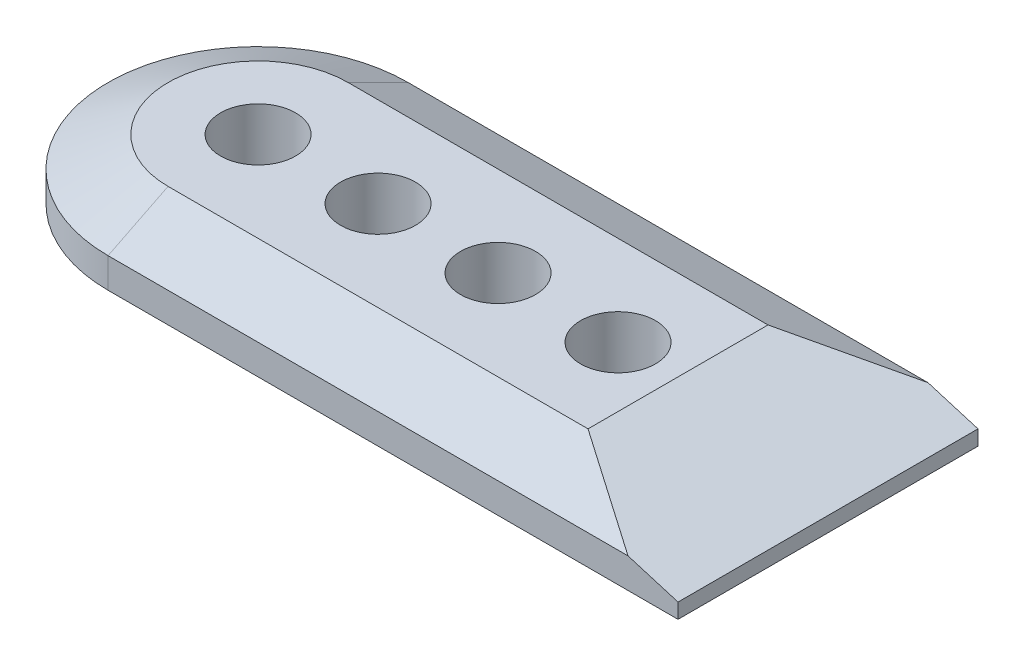
ISO-10303-21;
HEADER;
FILE_DESCRIPTION(('STEP AP214'),'2;1');
FILE_NAME('part.step','',(''),(''),'','','');
FILE_SCHEMA(('AUTOMOTIVE_DESIGN { 1 0 10303 214 1 1 1 1 }'));
ENDSEC;
DATA;
#1=APPLICATION_CONTEXT('core data for automotive mechanical design processes');
#2=APPLICATION_PROTOCOL_DEFINITION('international standard','automotive_design',2000,#1);
#3=PRODUCT_CONTEXT('',#1,'mechanical');
#4=PRODUCT('Part','Part','',(#3));
#5=PRODUCT_RELATED_PRODUCT_CATEGORY('part','',(#4));
#6=PRODUCT_DEFINITION_FORMATION('','',#4);
#7=PRODUCT_DEFINITION_CONTEXT('part definition',#1,'design');
#8=PRODUCT_DEFINITION('design','',#6,#7);
#9=PRODUCT_DEFINITION_SHAPE('','',#8);
#10=(LENGTH_UNIT() NAMED_UNIT(*) SI_UNIT(.MILLI.,.METRE.));
#11=(NAMED_UNIT(*) PLANE_ANGLE_UNIT() SI_UNIT($,.RADIAN.));
#12=(NAMED_UNIT(*) SI_UNIT($,.STERADIAN.) SOLID_ANGLE_UNIT());
#13=UNCERTAINTY_MEASURE_WITH_UNIT(LENGTH_MEASURE(1.E-05),#10,'distance_accuracy_value','');
#14=(GEOMETRIC_REPRESENTATION_CONTEXT(3) GLOBAL_UNCERTAINTY_ASSIGNED_CONTEXT((#13)) GLOBAL_UNIT_ASSIGNED_CONTEXT((#10,
#11,#12)) REPRESENTATION_CONTEXT('',''));
#15=CARTESIAN_POINT('',(0.,0.,0.));
#16=DIRECTION('',(0.,0.,1.));
#17=DIRECTION('',(1.,0.,0.));
#18=AXIS2_PLACEMENT_3D('',#15,#16,#17);
#19=CARTESIAN_POINT('',(-47.5,5.,0.));
#20=DIRECTION('',(0.,1.,0.));
#21=DIRECTION('',(0.,0.,1.));
#22=AXIS2_PLACEMENT_3D('',#19,#20,#21);
#23=PLANE('',#22);
#24=CARTESIAN_POINT('',(-27.5,5.,0.));
#25=DIRECTION('',(0.,1.,0.));
#26=DIRECTION('',(0.,0.,1.));
#27=AXIS2_PLACEMENT_3D('',#24,#25,#26);
#28=CIRCLE('',#27,3.125);
#29=CARTESIAN_POINT('',(-27.5,5.,3.125));
#30=VERTEX_POINT('',#29);
#31=EDGE_CURVE('E321',#30,#30,#28,.T.);
#32=ORIENTED_EDGE('',*,*,#31,.F.);
#33=EDGE_LOOP('',(#32));
#34=FACE_BOUND('',#33,.T.);
#35=CARTESIAN_POINT('',(-47.5,5.,0.));
#36=DIRECTION('',(0.,1.,0.));
#37=DIRECTION('',(0.,0.,1.));
#38=AXIS2_PLACEMENT_3D('',#35,#36,#37);
#39=CIRCLE('',#38,3.125);
#40=CARTESIAN_POINT('',(-47.5,5.,3.125));
#41=VERTEX_POINT('',#40);
#42=EDGE_CURVE('E116',#41,#41,#39,.T.);
#43=ORIENTED_EDGE('',*,*,#42,.F.);
#44=EDGE_LOOP('',(#43));
#45=FACE_BOUND('',#44,.T.);
#46=DIRECTION('',(1.,0.,0.));
#47=VECTOR('',#46,1.);
#48=CARTESIAN_POINT('',(0.,5.,7.49999999999996));
#49=LINE('',#48,#47);
#50=CARTESIAN_POINT('',(-47.5,5.,7.49999999999998));
#51=VERTEX_POINT('',#50);
#52=CARTESIAN_POINT('',(-12.5000000000002,5.,7.49999999999996));
#53=VERTEX_POINT('',#52);
#54=EDGE_CURVE('E133',#51,#53,#49,.T.);
#55=ORIENTED_EDGE('',*,*,#54,.T.);
#56=DIRECTION('',(0.,0.,-1.));
#57=VECTOR('',#56,1.);
#58=CARTESIAN_POINT('',(-12.5000000000002,5.,-7.49999999999997));
#59=LINE('',#58,#57);
#60=CARTESIAN_POINT('',(-12.5000000000002,5.,-7.49999999999997));
#61=VERTEX_POINT('',#60);
#62=EDGE_CURVE('E143',#53,#61,#59,.T.);
#63=ORIENTED_EDGE('',*,*,#62,.T.);
#64=DIRECTION('',(-1.,0.,0.));
#65=VECTOR('',#64,1.);
#66=CARTESIAN_POINT('',(-47.5,5.,-7.49999999999997));
#67=LINE('',#66,#65);
#68=CARTESIAN_POINT('',(-47.5,5.,-7.49999999999997));
#69=VERTEX_POINT('',#68);
#70=EDGE_CURVE('E100',#61,#69,#67,.T.);
#71=ORIENTED_EDGE('',*,*,#70,.T.);
#72=CARTESIAN_POINT('',(-47.5,5.,0.));
#73=DIRECTION('',(0.,1.,0.));
#74=DIRECTION('',(0.,0.,1.));
#75=AXIS2_PLACEMENT_3D('',#72,#73,#74);
#76=CIRCLE('',#75,7.49999999999997);
#77=EDGE_CURVE('E131',#69,#51,#76,.T.);
#78=ORIENTED_EDGE('',*,*,#77,.T.);
#79=EDGE_LOOP('',(#55,#63,#71,#78));
#80=FACE_BOUND('',#79,.T.);
#81=CARTESIAN_POINT('',(-37.5,5.,0.));
#82=DIRECTION('',(0.,1.,0.));
#83=DIRECTION('',(0.,0.,1.));
#84=AXIS2_PLACEMENT_3D('',#81,#82,#83);
#85=CIRCLE('',#84,3.125);
#86=CARTESIAN_POINT('',(-37.5,5.,3.125));
#87=VERTEX_POINT('',#86);
#88=EDGE_CURVE('E315',#87,#87,#85,.T.);
#89=ORIENTED_EDGE('',*,*,#88,.F.);
#90=EDGE_LOOP('',(#89));
#91=FACE_BOUND('',#90,.T.);
#92=CARTESIAN_POINT('',(-17.5,5.,0.));
#93=DIRECTION('',(0.,1.,0.));
#94=DIRECTION('',(0.,0.,1.));
#95=AXIS2_PLACEMENT_3D('',#92,#93,#94);
#96=CIRCLE('',#95,3.125);
#97=CARTESIAN_POINT('',(-17.5,5.,3.125));
#98=VERTEX_POINT('',#97);
#99=EDGE_CURVE('E327',#98,#98,#96,.T.);
#100=ORIENTED_EDGE('',*,*,#99,.F.);
#101=EDGE_LOOP('',(#100));
#102=FACE_BOUND('',#101,.T.);
#103=ADVANCED_FACE('F37',(#34,#45,#80,#91,#102),#23,.T.);
#104=CARTESIAN_POINT('',(-47.5,0.,0.));
#105=DIRECTION('',(0.,1.,0.));
#106=DIRECTION('',(0.,0.,1.));
#107=AXIS2_PLACEMENT_3D('',#104,#105,#106);
#108=PLANE('',#107);
#109=DIRECTION('',(1.,0.,0.));
#110=VECTOR('',#109,1.);
#111=CARTESIAN_POINT('',(0.,0.,12.5));
#112=LINE('',#111,#110);
#113=CARTESIAN_POINT('',(-47.5,0.,12.5));
#114=VERTEX_POINT('',#113);
#115=CARTESIAN_POINT('',(0.,0.,12.5));
#116=VERTEX_POINT('',#115);
#117=EDGE_CURVE('E108',#114,#116,#112,.T.);
#118=ORIENTED_EDGE('',*,*,#117,.F.);
#119=CARTESIAN_POINT('',(-47.5,0.,0.));
#120=DIRECTION('',(0.,1.,0.));
#121=DIRECTION('',(0.,0.,1.));
#122=AXIS2_PLACEMENT_3D('',#119,#120,#121);
#123=CIRCLE('',#122,12.5);
#124=CARTESIAN_POINT('',(-47.5,0.,-12.5));
#125=VERTEX_POINT('',#124);
#126=EDGE_CURVE('E124',#125,#114,#123,.T.);
#127=ORIENTED_EDGE('',*,*,#126,.F.);
#128=DIRECTION('',(-1.,0.,0.));
#129=VECTOR('',#128,1.);
#130=CARTESIAN_POINT('',(0.,0.,-12.5));
#131=LINE('',#130,#129);
#132=CARTESIAN_POINT('',(0.,0.,-12.5));
#133=VERTEX_POINT('',#132);
#134=EDGE_CURVE('E110',#133,#125,#131,.T.);
#135=ORIENTED_EDGE('',*,*,#134,.F.);
#136=DIRECTION('',(0.,0.,-1.));
#137=VECTOR('',#136,1.);
#138=CARTESIAN_POINT('',(0.,0.,12.5));
#139=LINE('',#138,#137);
#140=EDGE_CURVE('E97',#116,#133,#139,.T.);
#141=ORIENTED_EDGE('',*,*,#140,.F.);
#142=EDGE_LOOP('',(#118,#127,#135,#141));
#143=FACE_BOUND('',#142,.T.);
#144=CARTESIAN_POINT('',(-47.5,0.,0.));
#145=DIRECTION('',(0.,1.,0.));
#146=DIRECTION('',(0.,0.,1.));
#147=AXIS2_PLACEMENT_3D('',#144,#145,#146);
#148=CIRCLE('',#147,3.125);
#149=CARTESIAN_POINT('',(-47.5,0.,3.125));
#150=VERTEX_POINT('',#149);
#151=EDGE_CURVE('E119',#150,#150,#148,.T.);
#152=ORIENTED_EDGE('',*,*,#151,.T.);
#153=EDGE_LOOP('',(#152));
#154=FACE_BOUND('',#153,.T.);
#155=CARTESIAN_POINT('',(-37.5,0.,0.));
#156=DIRECTION('',(0.,1.,0.));
#157=DIRECTION('',(0.,0.,1.));
#158=AXIS2_PLACEMENT_3D('',#155,#156,#157);
#159=CIRCLE('',#158,3.125);
#160=CARTESIAN_POINT('',(-37.5,0.,3.125));
#161=VERTEX_POINT('',#160);
#162=EDGE_CURVE('E317',#161,#161,#159,.T.);
#163=ORIENTED_EDGE('',*,*,#162,.T.);
#164=EDGE_LOOP('',(#163));
#165=FACE_BOUND('',#164,.T.);
#166=CARTESIAN_POINT('',(-27.5,0.,0.));
#167=DIRECTION('',(0.,1.,0.));
#168=DIRECTION('',(0.,0.,1.));
#169=AXIS2_PLACEMENT_3D('',#166,#167,#168);
#170=CIRCLE('',#169,3.125);
#171=CARTESIAN_POINT('',(-27.5,0.,3.125));
#172=VERTEX_POINT('',#171);
#173=EDGE_CURVE('E324',#172,#172,#170,.T.);
#174=ORIENTED_EDGE('',*,*,#173,.T.);
#175=EDGE_LOOP('',(#174));
#176=FACE_BOUND('',#175,.T.);
#177=CARTESIAN_POINT('',(-17.5,0.,0.));
#178=DIRECTION('',(0.,1.,0.));
#179=DIRECTION('',(0.,0.,1.));
#180=AXIS2_PLACEMENT_3D('',#177,#178,#179);
#181=CIRCLE('',#180,3.125);
#182=CARTESIAN_POINT('',(-17.5,0.,3.125));
#183=VERTEX_POINT('',#182);
#184=EDGE_CURVE('E150',#183,#183,#181,.T.);
#185=ORIENTED_EDGE('',*,*,#184,.T.);
#186=EDGE_LOOP('',(#185));
#187=FACE_BOUND('',#186,.T.);
#188=ADVANCED_FACE('F105',(#143,#154,#165,#176,#187),#108,.F.);
#189=CARTESIAN_POINT('',(0.,5.,12.5));
#190=DIRECTION('',(0.,0.,-1.));
#191=DIRECTION('',(-1.,0.,0.));
#192=AXIS2_PLACEMENT_3D('',#189,#190,#191);
#193=PLANE('',#192);
#194=DIRECTION('',(0.,-1.,0.));
#195=VECTOR('',#194,1.);
#196=CARTESIAN_POINT('',(0.,5.,12.5));
#197=LINE('',#196,#195);
#198=CARTESIAN_POINT('',(0.,1.24999999999999,12.5));
#199=VERTEX_POINT('',#198);
#200=EDGE_CURVE('E94',#199,#116,#197,.T.);
#201=ORIENTED_EDGE('',*,*,#200,.F.);
#202=DIRECTION('',(-0.957826285221152,0.287347885566343,0.));
#203=VECTOR('',#202,1.);
#204=CARTESIAN_POINT('',(-12.5000000000002,5.,12.5));
#205=LINE('',#204,#203);
#206=CARTESIAN_POINT('',(-4.16666666666672,2.49999999999999,12.5));
#207=VERTEX_POINT('',#206);
#208=EDGE_CURVE('E46',#199,#207,#205,.T.);
#209=ORIENTED_EDGE('',*,*,#208,.T.);
#210=DIRECTION('',(-1.,0.,0.));
#211=VECTOR('',#210,1.);
#212=CARTESIAN_POINT('',(-47.5,2.49999999999999,12.5));
#213=LINE('',#212,#211);
#214=CARTESIAN_POINT('',(-47.5,2.5,12.5));
#215=VERTEX_POINT('',#214);
#216=EDGE_CURVE('E136',#207,#215,#213,.T.);
#217=ORIENTED_EDGE('',*,*,#216,.T.);
#218=DIRECTION('',(0.,-1.,0.));
#219=VECTOR('',#218,1.);
#220=CARTESIAN_POINT('',(-47.5,5.,12.5));
#221=LINE('',#220,#219);
#222=EDGE_CURVE('E114',#215,#114,#221,.T.);
#223=ORIENTED_EDGE('',*,*,#222,.T.);
#224=ORIENTED_EDGE('',*,*,#117,.T.);
#225=EDGE_LOOP('',(#201,#209,#217,#223,#224));
#226=FACE_BOUND('',#225,.T.);
#227=ADVANCED_FACE('F112',(#226),#193,.F.);
#228=CARTESIAN_POINT('',(0.,5.,12.5));
#229=DIRECTION('',(-1.,0.,0.));
#230=DIRECTION('',(0.,0.,1.));
#231=AXIS2_PLACEMENT_3D('',#228,#229,#230);
#232=PLANE('',#231);
#233=DIRECTION('',(0.,-1.,0.));
#234=VECTOR('',#233,1.);
#235=CARTESIAN_POINT('',(0.,5.,-12.5));
#236=LINE('',#235,#234);
#237=CARTESIAN_POINT('',(0.,1.24999999999999,-12.5));
#238=VERTEX_POINT('',#237);
#239=EDGE_CURVE('E101',#238,#133,#236,.T.);
#240=ORIENTED_EDGE('',*,*,#239,.F.);
#241=DIRECTION('',(0.,0.,1.));
#242=VECTOR('',#241,1.);
#243=CARTESIAN_POINT('',(0.,1.24999999999999,7.49999999999996));
#244=LINE('',#243,#242);
#245=EDGE_CURVE('E60',#238,#199,#244,.T.);
#246=ORIENTED_EDGE('',*,*,#245,.T.);
#247=ORIENTED_EDGE('',*,*,#200,.T.);
#248=ORIENTED_EDGE('',*,*,#140,.T.);
#249=EDGE_LOOP('',(#240,#246,#247,#248));
#250=FACE_BOUND('',#249,.T.);
#251=ADVANCED_FACE('F96',(#250),#232,.F.);
#252=CARTESIAN_POINT('',(0.,5.,-12.5));
#253=DIRECTION('',(0.,0.,1.));
#254=DIRECTION('',(1.,0.,0.));
#255=AXIS2_PLACEMENT_3D('',#252,#253,#254);
#256=PLANE('',#255);
#257=DIRECTION('',(1.,0.,0.));
#258=VECTOR('',#257,1.);
#259=CARTESIAN_POINT('',(0.,2.5,-12.5));
#260=LINE('',#259,#258);
#261=CARTESIAN_POINT('',(-47.5,2.5,-12.5));
#262=VERTEX_POINT('',#261);
#263=CARTESIAN_POINT('',(-4.16666666666675,2.5,-12.5));
#264=VERTEX_POINT('',#263);
#265=EDGE_CURVE('E140',#262,#264,#260,.T.);
#266=ORIENTED_EDGE('',*,*,#265,.T.);
#267=DIRECTION('',(0.957826285221152,-0.287347885566343,0.));
#268=VECTOR('',#267,1.);
#269=CARTESIAN_POINT('',(-12.5000000000002,5.,-12.5));
#270=LINE('',#269,#268);
#271=EDGE_CURVE('E155',#264,#238,#270,.T.);
#272=ORIENTED_EDGE('',*,*,#271,.T.);
#273=ORIENTED_EDGE('',*,*,#239,.T.);
#274=ORIENTED_EDGE('',*,*,#134,.T.);
#275=DIRECTION('',(0.,-1.,0.));
#276=VECTOR('',#275,1.);
#277=CARTESIAN_POINT('',(-47.5,5.,-12.5));
#278=LINE('',#277,#276);
#279=EDGE_CURVE('E127',#262,#125,#278,.T.);
#280=ORIENTED_EDGE('',*,*,#279,.F.);
#281=EDGE_LOOP('',(#266,#272,#273,#274,#280));
#282=FACE_BOUND('',#281,.T.);
#283=ADVANCED_FACE('F159',(#282),#256,.F.);
#284=CARTESIAN_POINT('',(-47.5,5.,0.));
#285=DIRECTION('',(0.,-1.,0.));
#286=DIRECTION('',(0.,0.,-1.));
#287=AXIS2_PLACEMENT_3D('',#284,#285,#286);
#288=CYLINDRICAL_SURFACE('',#287,12.5);
#289=ORIENTED_EDGE('',*,*,#222,.F.);
#290=CARTESIAN_POINT('',(-47.5,2.5,0.));
#291=DIRECTION('',(0.,1.,0.));
#292=DIRECTION('',(0.,0.,1.));
#293=AXIS2_PLACEMENT_3D('',#290,#291,#292);
#294=CIRCLE('',#293,12.5);
#295=EDGE_CURVE('E138',#215,#262,#294,.F.);
#296=ORIENTED_EDGE('',*,*,#295,.T.);
#297=ORIENTED_EDGE('',*,*,#279,.T.);
#298=ORIENTED_EDGE('',*,*,#126,.T.);
#299=EDGE_LOOP('',(#289,#296,#297,#298));
#300=FACE_BOUND('',#299,.T.);
#301=ADVANCED_FACE('F178',(#300),#288,.T.);
#302=CARTESIAN_POINT('',(-47.5,5.,0.));
#303=DIRECTION('',(0.,-1.,0.));
#304=DIRECTION('',(0.,0.,-1.));
#305=AXIS2_PLACEMENT_3D('',#302,#303,#304);
#306=CYLINDRICAL_SURFACE('',#305,3.125);
#307=ORIENTED_EDGE('',*,*,#42,.T.);
#308=EDGE_LOOP('',(#307));
#309=FACE_BOUND('',#308,.T.);
#310=ORIENTED_EDGE('',*,*,#151,.F.);
#311=EDGE_LOOP('',(#310));
#312=FACE_BOUND('',#311,.T.);
#313=ADVANCED_FACE('F202',(#309,#312),#306,.F.);
#314=CARTESIAN_POINT('',(-37.5,5.,0.));
#315=DIRECTION('',(0.,-1.,0.));
#316=DIRECTION('',(0.,0.,-1.));
#317=AXIS2_PLACEMENT_3D('',#314,#315,#316);
#318=CYLINDRICAL_SURFACE('',#317,3.125);
#319=ORIENTED_EDGE('',*,*,#88,.T.);
#320=EDGE_LOOP('',(#319));
#321=FACE_BOUND('',#320,.T.);
#322=ORIENTED_EDGE('',*,*,#162,.F.);
#323=EDGE_LOOP('',(#322));
#324=FACE_BOUND('',#323,.T.);
#325=ADVANCED_FACE('F287',(#321,#324),#318,.F.);
#326=CARTESIAN_POINT('',(-27.5,5.,0.));
#327=DIRECTION('',(0.,-1.,0.));
#328=DIRECTION('',(0.,0.,-1.));
#329=AXIS2_PLACEMENT_3D('',#326,#327,#328);
#330=CYLINDRICAL_SURFACE('',#329,3.125);
#331=ORIENTED_EDGE('',*,*,#31,.T.);
#332=EDGE_LOOP('',(#331));
#333=FACE_BOUND('',#332,.T.);
#334=ORIENTED_EDGE('',*,*,#173,.F.);
#335=EDGE_LOOP('',(#334));
#336=FACE_BOUND('',#335,.T.);
#337=ADVANCED_FACE('F188',(#333,#336),#330,.F.);
#338=CARTESIAN_POINT('',(-17.5,5.,0.));
#339=DIRECTION('',(0.,-1.,0.));
#340=DIRECTION('',(0.,0.,-1.));
#341=AXIS2_PLACEMENT_3D('',#338,#339,#340);
#342=CYLINDRICAL_SURFACE('',#341,3.125);
#343=ORIENTED_EDGE('',*,*,#99,.T.);
#344=EDGE_LOOP('',(#343));
#345=FACE_BOUND('',#344,.T.);
#346=ORIENTED_EDGE('',*,*,#184,.F.);
#347=EDGE_LOOP('',(#346));
#348=FACE_BOUND('',#347,.T.);
#349=ADVANCED_FACE('F182',(#345,#348),#342,.F.);
#350=CARTESIAN_POINT('',(-47.5,5.,-7.49999999999997));
#351=DIRECTION('',(0.,0.894427190999917,-0.447213595499956));
#352=DIRECTION('',(1.,0.,0.));
#353=AXIS2_PLACEMENT_3D('',#350,#351,#352);
#354=PLANE('',#353);
#355=ORIENTED_EDGE('',*,*,#70,.F.);
#356=DIRECTION('',(0.830454798537401,-0.249136439561218,-0.498272879122438));
#357=VECTOR('',#356,1.);
#358=CARTESIAN_POINT('',(-36.6379310344829,12.2413793103447,6.9827586206896));
#359=LINE('',#358,#357);
#360=EDGE_CURVE('E153',#61,#264,#359,.T.);
#361=ORIENTED_EDGE('',*,*,#360,.T.);
#362=ORIENTED_EDGE('',*,*,#265,.F.);
#363=DIRECTION('',(0.,-0.447213595499956,-0.894427190999917));
#364=VECTOR('',#363,1.);
#365=CARTESIAN_POINT('',(-47.5,5.,-7.49999999999997));
#366=LINE('',#365,#364);
#367=EDGE_CURVE('E147',#69,#262,#366,.T.);
#368=ORIENTED_EDGE('',*,*,#367,.F.);
#369=EDGE_LOOP('',(#355,#361,#362,#368));
#370=FACE_BOUND('',#369,.T.);
#371=ADVANCED_FACE('F180',(#370),#354,.T.);
#372=CARTESIAN_POINT('',(-47.5,5.,0.));
#373=DIRECTION('',(0.,-1.,0.));
#374=DIRECTION('',(0.,0.,-1.));
#375=AXIS2_PLACEMENT_3D('',#372,#373,#374);
#376=CONICAL_SURFACE('',#375,7.49999999999997,1.10714871779409);
#377=ORIENTED_EDGE('',*,*,#367,.T.);
#378=ORIENTED_EDGE('',*,*,#295,.F.);
#379=DIRECTION('',(0.,-0.447213595499956,0.894427190999917));
#380=VECTOR('',#379,1.);
#381=CARTESIAN_POINT('',(-47.5,5.,7.49999999999998));
#382=LINE('',#381,#380);
#383=EDGE_CURVE('E144',#51,#215,#382,.T.);
#384=ORIENTED_EDGE('',*,*,#383,.F.);
#385=ORIENTED_EDGE('',*,*,#77,.F.);
#386=EDGE_LOOP('',(#377,#378,#384,#385));
#387=FACE_BOUND('',#386,.T.);
#388=ADVANCED_FACE('F176',(#387),#376,.T.);
#389=CARTESIAN_POINT('',(-47.5,5.,7.49999999999997));
#390=DIRECTION('',(0.,0.894427190999917,0.447213595499956));
#391=DIRECTION('',(-1.,0.,0.));
#392=AXIS2_PLACEMENT_3D('',#389,#390,#391);
#393=PLANE('',#392);
#394=ORIENTED_EDGE('',*,*,#216,.F.);
#395=DIRECTION('',(-0.830454798537401,0.249136439561218,-0.498272879122438));
#396=VECTOR('',#395,1.);
#397=CARTESIAN_POINT('',(-36.6379310344829,12.2413793103447,-6.98275862068961));
#398=LINE('',#397,#396);
#399=EDGE_CURVE('E11',#207,#53,#398,.T.);
#400=ORIENTED_EDGE('',*,*,#399,.T.);
#401=ORIENTED_EDGE('',*,*,#54,.F.);
#402=ORIENTED_EDGE('',*,*,#383,.T.);
#403=EDGE_LOOP('',(#394,#400,#401,#402));
#404=FACE_BOUND('',#403,.T.);
#405=ADVANCED_FACE('F167',(#404),#393,.T.);
#406=CARTESIAN_POINT('',(-12.5000000000002,5.,0.));
#407=DIRECTION('',(0.287347885566343,0.957826285221152,0.));
#408=DIRECTION('',(0.,0.,1.));
#409=AXIS2_PLACEMENT_3D('',#406,#407,#408);
#410=PLANE('',#409);
#411=ORIENTED_EDGE('',*,*,#208,.F.);
#412=ORIENTED_EDGE('',*,*,#245,.F.);
#413=ORIENTED_EDGE('',*,*,#271,.F.);
#414=ORIENTED_EDGE('',*,*,#360,.F.);
#415=ORIENTED_EDGE('',*,*,#62,.F.);
#416=ORIENTED_EDGE('',*,*,#399,.F.);
#417=EDGE_LOOP('',(#411,#412,#413,#414,#415,#416));
#418=FACE_BOUND('',#417,.T.);
#419=ADVANCED_FACE('F40',(#418),#410,.T.);
#420=CLOSED_SHELL('',(#103,#188,#227,#251,#283,#301,#313,#325,#337,#349,#371,#388,#405,#419));
#421=MANIFOLD_SOLID_BREP('B2',#420);
#422=ADVANCED_BREP_SHAPE_REPRESENTATION('',(#18,#421),#14);
#423=SHAPE_DEFINITION_REPRESENTATION(#9,#422);
ENDSEC;
END-ISO-10303-21;
